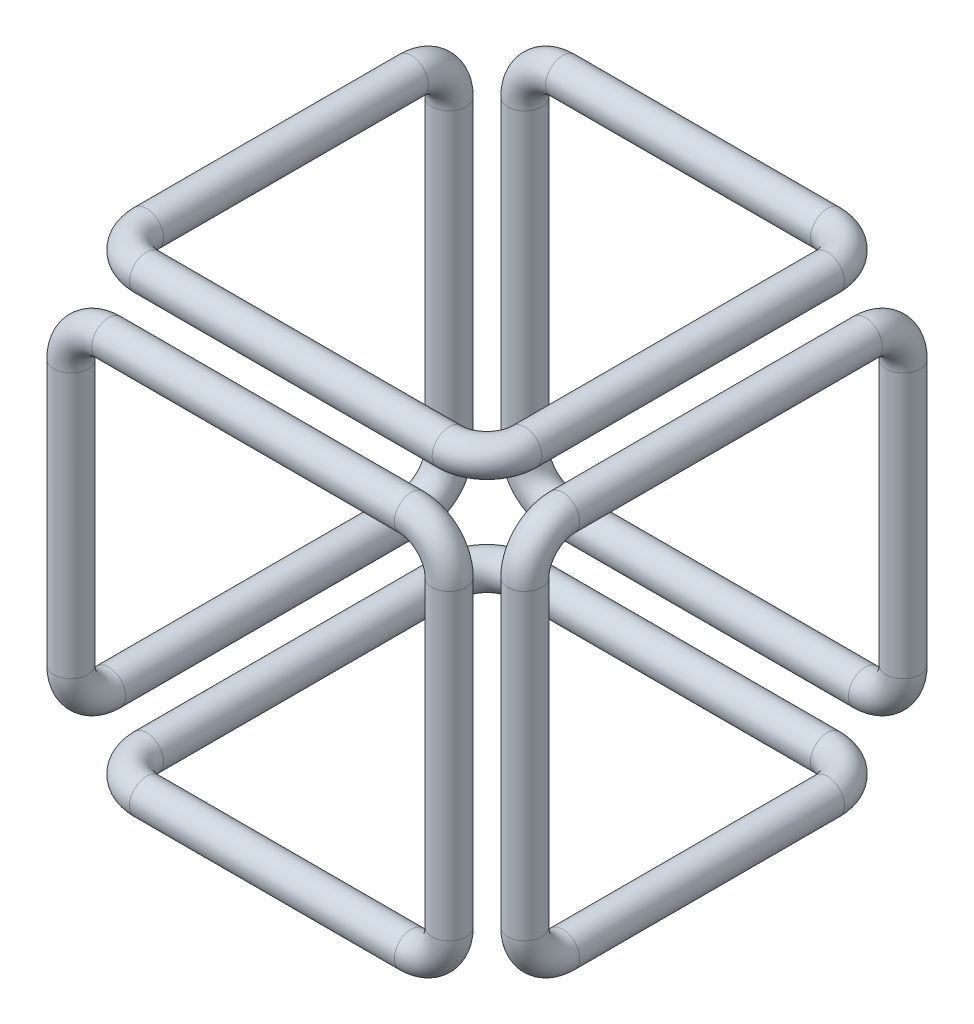
ISO-10303-21;
HEADER;
FILE_DESCRIPTION(('STEP AP214'),'2;1');
FILE_NAME('part.step','',(''),(''),'','','');
FILE_SCHEMA(('AUTOMOTIVE_DESIGN { 1 0 10303 214 1 1 1 1 }'));
ENDSEC;
DATA;
#1=APPLICATION_CONTEXT('core data for automotive mechanical design processes');
#2=APPLICATION_PROTOCOL_DEFINITION('international standard','automotive_design',2000,#1);
#3=PRODUCT_CONTEXT('',#1,'mechanical');
#4=PRODUCT('Part','Part','',(#3));
#5=PRODUCT_RELATED_PRODUCT_CATEGORY('part','',(#4));
#6=PRODUCT_DEFINITION_FORMATION('','',#4);
#7=PRODUCT_DEFINITION_CONTEXT('part definition',#1,'design');
#8=PRODUCT_DEFINITION('design','',#6,#7);
#9=PRODUCT_DEFINITION_SHAPE('','',#8);
#10=(LENGTH_UNIT() NAMED_UNIT(*) SI_UNIT(.MILLI.,.METRE.));
#11=(NAMED_UNIT(*) PLANE_ANGLE_UNIT() SI_UNIT($,.RADIAN.));
#12=(NAMED_UNIT(*) SI_UNIT($,.STERADIAN.) SOLID_ANGLE_UNIT());
#13=UNCERTAINTY_MEASURE_WITH_UNIT(LENGTH_MEASURE(1.E-05),#10,'distance_accuracy_value','');
#14=(GEOMETRIC_REPRESENTATION_CONTEXT(3) GLOBAL_UNCERTAINTY_ASSIGNED_CONTEXT((#13)) GLOBAL_UNIT_ASSIGNED_CONTEXT((#10,
#11,#12)) REPRESENTATION_CONTEXT('',''));
#15=CARTESIAN_POINT('',(0.,0.,0.));
#16=DIRECTION('',(0.,0.,1.));
#17=DIRECTION('',(1.,0.,0.));
#18=AXIS2_PLACEMENT_3D('',#15,#16,#17);
#19=CARTESIAN_POINT('',(90.,0.,10.));
#20=DIRECTION('',(0.,1.,0.));
#21=DIRECTION('',(0.,0.,1.));
#22=AXIS2_PLACEMENT_3D('',#19,#20,#21);
#23=TOROIDAL_SURFACE('',#22,9.99999999999999,4.5);
#24=CARTESIAN_POINT('',(100.,0.,10.));
#25=DIRECTION('',(0.,0.,1.));
#26=DIRECTION('',(1.,0.,0.));
#27=AXIS2_PLACEMENT_3D('',#24,#25,#26);
#28=CIRCLE('',#27,4.5);
#29=CARTESIAN_POINT('',(104.5,0.,10.));
#30=VERTEX_POINT('',#29);
#31=EDGE_CURVE('E185',#30,#30,#28,.T.);
#32=CARTESIAN_POINT('',(90.,0.,0.));
#33=DIRECTION('',(1.,0.,0.));
#34=DIRECTION('',(0.,0.,-1.));
#35=AXIS2_PLACEMENT_3D('',#32,#33,#34);
#36=CIRCLE('',#35,4.5);
#37=CARTESIAN_POINT('',(90.,0.,-4.5));
#38=VERTEX_POINT('',#37);
#39=EDGE_CURVE('E181',#38,#38,#36,.T.);
#40=CARTESIAN_POINT('',(90.,0.,10.));
#41=DIRECTION('',(0.,1.,0.));
#42=DIRECTION('',(0.,0.,1.));
#43=AXIS2_PLACEMENT_3D('',#40,#41,#42);
#44=CIRCLE('',#43,14.5);
#45=EDGE_CURVE('',#30,#38,#44,.T.);
#46=ORIENTED_EDGE('',*,*,#31,.F.);
#47=ORIENTED_EDGE('',*,*,#39,.T.);
#48=ORIENTED_EDGE('',*,*,#45,.T.);
#49=ORIENTED_EDGE('',*,*,#45,.F.);
#50=EDGE_LOOP('',(#46,#48,#47,#49));
#51=FACE_BOUND('',#50,.T.);
#52=ADVANCED_FACE('F37',(#51),#23,.T.);
#53=CARTESIAN_POINT('',(90.,0.,0.));
#54=DIRECTION('',(-1.,0.,0.));
#55=DIRECTION('',(0.,0.,1.));
#56=AXIS2_PLACEMENT_3D('',#53,#54,#55);
#57=CYLINDRICAL_SURFACE('',#56,4.5);
#58=CARTESIAN_POINT('',(9.99999999999999,0.,0.));
#59=DIRECTION('',(1.,0.,0.));
#60=DIRECTION('',(0.,0.,-1.));
#61=AXIS2_PLACEMENT_3D('',#58,#59,#60);
#62=CIRCLE('',#61,4.5);
#63=CARTESIAN_POINT('',(9.99999999999999,0.,-4.5));
#64=VERTEX_POINT('',#63);
#65=EDGE_CURVE('E177',#64,#64,#62,.T.);
#66=ORIENTED_EDGE('',*,*,#65,.T.);
#67=EDGE_LOOP('',(#66));
#68=FACE_BOUND('',#67,.T.);
#69=ORIENTED_EDGE('',*,*,#39,.F.);
#70=EDGE_LOOP('',(#69));
#71=FACE_BOUND('',#70,.T.);
#72=ADVANCED_FACE('F193',(#68,#71),#57,.T.);
#73=CARTESIAN_POINT('',(10.,0.,9.99999999999999));
#74=DIRECTION('',(0.,1.,0.));
#75=DIRECTION('',(0.,0.,1.));
#76=AXIS2_PLACEMENT_3D('',#73,#74,#75);
#77=TOROIDAL_SURFACE('',#76,9.99999999999999,4.5);
#78=CARTESIAN_POINT('',(0.,0.,9.99999999999999));
#79=DIRECTION('',(0.,0.,-1.));
#80=DIRECTION('',(-1.,0.,0.));
#81=AXIS2_PLACEMENT_3D('',#78,#79,#80);
#82=CIRCLE('',#81,4.5);
#83=CARTESIAN_POINT('',(-4.5,0.,9.99999999999999));
#84=VERTEX_POINT('',#83);
#85=EDGE_CURVE('E173',#84,#84,#82,.T.);
#86=CARTESIAN_POINT('',(10.,0.,9.99999999999999));
#87=DIRECTION('',(0.,1.,0.));
#88=DIRECTION('',(0.,0.,1.));
#89=AXIS2_PLACEMENT_3D('',#86,#87,#88);
#90=CIRCLE('',#89,14.5);
#91=EDGE_CURVE('',#64,#84,#90,.T.);
#92=ORIENTED_EDGE('',*,*,#65,.F.);
#93=ORIENTED_EDGE('',*,*,#85,.T.);
#94=ORIENTED_EDGE('',*,*,#91,.T.);
#95=ORIENTED_EDGE('',*,*,#91,.F.);
#96=EDGE_LOOP('',(#92,#94,#93,#95));
#97=FACE_BOUND('',#96,.T.);
#98=ADVANCED_FACE('F199',(#97),#77,.T.);
#99=CARTESIAN_POINT('',(0.,0.,9.99999999999999));
#100=DIRECTION('',(0.,0.,1.));
#101=DIRECTION('',(0.,-1.,0.));
#102=AXIS2_PLACEMENT_3D('',#99,#100,#101);
#103=CYLINDRICAL_SURFACE('',#102,4.5);
#104=CARTESIAN_POINT('',(0.,0.,89.9999999999998));
#105=DIRECTION('',(0.,0.,-1.));
#106=DIRECTION('',(-1.,0.,0.));
#107=AXIS2_PLACEMENT_3D('',#104,#105,#106);
#108=CIRCLE('',#107,4.5);
#109=CARTESIAN_POINT('',(-4.50000000000001,0.,89.9999999999998));
#110=VERTEX_POINT('',#109);
#111=EDGE_CURVE('E169',#110,#110,#108,.T.);
#112=ORIENTED_EDGE('',*,*,#111,.T.);
#113=EDGE_LOOP('',(#112));
#114=FACE_BOUND('',#113,.T.);
#115=ORIENTED_EDGE('',*,*,#85,.F.);
#116=EDGE_LOOP('',(#115));
#117=FACE_BOUND('',#116,.T.);
#118=ADVANCED_FACE('F205',(#114,#117),#103,.T.);
#119=CARTESIAN_POINT('',(10.,0.,89.9999999999998));
#120=DIRECTION('',(0.,1.,0.));
#121=DIRECTION('',(-1.,0.,0.));
#122=AXIS2_PLACEMENT_3D('',#119,#120,#121);
#123=TOROIDAL_SURFACE('',#122,10.,4.5);
#124=CARTESIAN_POINT('',(10.,0.,99.9999999999998));
#125=DIRECTION('',(-1.,0.,0.));
#126=DIRECTION('',(0.,0.,1.));
#127=AXIS2_PLACEMENT_3D('',#124,#125,#126);
#128=CIRCLE('',#127,4.5);
#129=CARTESIAN_POINT('',(10.,0.,104.5));
#130=VERTEX_POINT('',#129);
#131=EDGE_CURVE('E165',#130,#130,#128,.T.);
#132=CARTESIAN_POINT('',(10.,0.,89.9999999999998));
#133=DIRECTION('',(0.,1.,0.));
#134=DIRECTION('',(-1.,0.,0.));
#135=AXIS2_PLACEMENT_3D('',#132,#133,#134);
#136=CIRCLE('',#135,14.5);
#137=EDGE_CURVE('',#110,#130,#136,.T.);
#138=ORIENTED_EDGE('',*,*,#111,.F.);
#139=ORIENTED_EDGE('',*,*,#131,.T.);
#140=ORIENTED_EDGE('',*,*,#137,.T.);
#141=ORIENTED_EDGE('',*,*,#137,.F.);
#142=EDGE_LOOP('',(#138,#140,#139,#141));
#143=FACE_BOUND('',#142,.T.);
#144=ADVANCED_FACE('F209',(#143),#123,.T.);
#145=CARTESIAN_POINT('',(9.99999999999999,0.,99.9999999999998));
#146=DIRECTION('',(1.,0.,0.));
#147=DIRECTION('',(0.,0.,-1.));
#148=AXIS2_PLACEMENT_3D('',#145,#146,#147);
#149=CYLINDRICAL_SURFACE('',#148,4.5);
#150=CARTESIAN_POINT('',(80.,0.,99.9999999999998));
#151=DIRECTION('',(-1.,0.,0.));
#152=DIRECTION('',(0.,0.,1.));
#153=AXIS2_PLACEMENT_3D('',#150,#151,#152);
#154=CIRCLE('',#153,4.5);
#155=CARTESIAN_POINT('',(80.,-4.50000000000002,99.9999999999998));
#156=VERTEX_POINT('',#155);
#157=EDGE_CURVE('E161',#156,#156,#154,.T.);
#158=ORIENTED_EDGE('',*,*,#157,.T.);
#159=EDGE_LOOP('',(#158));
#160=FACE_BOUND('',#159,.T.);
#161=ORIENTED_EDGE('',*,*,#131,.F.);
#162=EDGE_LOOP('',(#161));
#163=FACE_BOUND('',#162,.T.);
#164=ADVANCED_FACE('F213',(#160,#163),#149,.T.);
#165=CARTESIAN_POINT('',(80.,9.99999999999998,99.9999999999998));
#166=DIRECTION('',(0.,0.,1.));
#167=DIRECTION('',(1.,0.,0.));
#168=AXIS2_PLACEMENT_3D('',#165,#166,#167);
#169=TOROIDAL_SURFACE('',#168,9.99999999999999,4.5);
#170=CARTESIAN_POINT('',(90.,9.99999999999998,99.9999999999998));
#171=DIRECTION('',(0.,-1.,0.));
#172=DIRECTION('',(0.,0.,1.));
#173=AXIS2_PLACEMENT_3D('',#170,#171,#172);
#174=CIRCLE('',#173,4.5);
#175=CARTESIAN_POINT('',(94.5,9.99999999999998,99.9999999999998));
#176=VERTEX_POINT('',#175);
#177=EDGE_CURVE('E157',#176,#176,#174,.T.);
#178=CARTESIAN_POINT('',(80.,9.99999999999998,99.9999999999998));
#179=DIRECTION('',(0.,0.,1.));
#180=DIRECTION('',(1.,0.,0.));
#181=AXIS2_PLACEMENT_3D('',#178,#179,#180);
#182=CIRCLE('',#181,14.5);
#183=EDGE_CURVE('',#156,#176,#182,.T.);
#184=ORIENTED_EDGE('',*,*,#157,.F.);
#185=ORIENTED_EDGE('',*,*,#177,.T.);
#186=ORIENTED_EDGE('',*,*,#183,.T.);
#187=ORIENTED_EDGE('',*,*,#183,.F.);
#188=EDGE_LOOP('',(#184,#186,#185,#187));
#189=FACE_BOUND('',#188,.T.);
#190=ADVANCED_FACE('F217',(#189),#169,.T.);
#191=CARTESIAN_POINT('',(90.,9.99999999999998,99.9999999999998));
#192=DIRECTION('',(0.,1.,0.));
#193=DIRECTION('',(0.,0.,1.));
#194=AXIS2_PLACEMENT_3D('',#191,#192,#193);
#195=CYLINDRICAL_SURFACE('',#194,4.5);
#196=CARTESIAN_POINT('',(90.,90.,99.9999999999998));
#197=DIRECTION('',(0.,-1.,0.));
#198=DIRECTION('',(0.,0.,1.));
#199=AXIS2_PLACEMENT_3D('',#196,#197,#198);
#200=CIRCLE('',#199,4.5);
#201=CARTESIAN_POINT('',(94.5,90.,99.9999999999998));
#202=VERTEX_POINT('',#201);
#203=EDGE_CURVE('E153',#202,#202,#200,.T.);
#204=ORIENTED_EDGE('',*,*,#203,.T.);
#205=EDGE_LOOP('',(#204));
#206=FACE_BOUND('',#205,.T.);
#207=ORIENTED_EDGE('',*,*,#177,.F.);
#208=EDGE_LOOP('',(#207));
#209=FACE_BOUND('',#208,.T.);
#210=ADVANCED_FACE('F221',(#206,#209),#195,.T.);
#211=CARTESIAN_POINT('',(80.,90.,99.9999999999998));
#212=DIRECTION('',(0.,0.,1.));
#213=DIRECTION('',(1.,0.,0.));
#214=AXIS2_PLACEMENT_3D('',#211,#212,#213);
#215=TOROIDAL_SURFACE('',#214,9.99999999999999,4.5);
#216=CARTESIAN_POINT('',(80.,100.,99.9999999999998));
#217=DIRECTION('',(1.,0.,0.));
#218=DIRECTION('',(0.,0.,1.));
#219=AXIS2_PLACEMENT_3D('',#216,#217,#218);
#220=CIRCLE('',#219,4.5);
#221=CARTESIAN_POINT('',(80.,104.5,99.9999999999998));
#222=VERTEX_POINT('',#221);
#223=EDGE_CURVE('E149',#222,#222,#220,.T.);
#224=CARTESIAN_POINT('',(80.,90.,99.9999999999998));
#225=DIRECTION('',(0.,0.,1.));
#226=DIRECTION('',(1.,0.,0.));
#227=AXIS2_PLACEMENT_3D('',#224,#225,#226);
#228=CIRCLE('',#227,14.5);
#229=EDGE_CURVE('',#202,#222,#228,.T.);
#230=ORIENTED_EDGE('',*,*,#203,.F.);
#231=ORIENTED_EDGE('',*,*,#223,.T.);
#232=ORIENTED_EDGE('',*,*,#229,.T.);
#233=ORIENTED_EDGE('',*,*,#229,.F.);
#234=EDGE_LOOP('',(#230,#232,#231,#233));
#235=FACE_BOUND('',#234,.T.);
#236=ADVANCED_FACE('F225',(#235),#215,.T.);
#237=CARTESIAN_POINT('',(80.,100.,99.9999999999998));
#238=DIRECTION('',(-1.,0.,0.));
#239=DIRECTION('',(0.,0.,1.));
#240=AXIS2_PLACEMENT_3D('',#237,#238,#239);
#241=CYLINDRICAL_SURFACE('',#240,4.5);
#242=CARTESIAN_POINT('',(0.,100.,99.9999999999998));
#243=DIRECTION('',(1.,0.,0.));
#244=DIRECTION('',(0.,0.,1.));
#245=AXIS2_PLACEMENT_3D('',#242,#243,#244);
#246=CIRCLE('',#245,4.5);
#247=CARTESIAN_POINT('',(0.,104.5,99.9999999999998));
#248=VERTEX_POINT('',#247);
#249=EDGE_CURVE('E145',#248,#248,#246,.T.);
#250=ORIENTED_EDGE('',*,*,#249,.T.);
#251=EDGE_LOOP('',(#250));
#252=FACE_BOUND('',#251,.T.);
#253=ORIENTED_EDGE('',*,*,#223,.F.);
#254=EDGE_LOOP('',(#253));
#255=FACE_BOUND('',#254,.T.);
#256=ADVANCED_FACE('F229',(#252,#255),#241,.T.);
#257=CARTESIAN_POINT('',(0.,90.,99.9999999999998));
#258=DIRECTION('',(0.,0.,1.));
#259=DIRECTION('',(1.,0.,0.));
#260=AXIS2_PLACEMENT_3D('',#257,#258,#259);
#261=TOROIDAL_SURFACE('',#260,9.99999999999999,4.5);
#262=CARTESIAN_POINT('',(-10.,90.0000000000001,99.9999999999998));
#263=DIRECTION('',(0.,1.,0.));
#264=DIRECTION('',(0.,0.,1.));
#265=AXIS2_PLACEMENT_3D('',#262,#263,#264);
#266=CIRCLE('',#265,4.5);
#267=CARTESIAN_POINT('',(-14.5,90.0000000000001,99.9999999999998));
#268=VERTEX_POINT('',#267);
#269=EDGE_CURVE('E141',#268,#268,#266,.T.);
#270=CARTESIAN_POINT('',(0.,90.,99.9999999999998));
#271=DIRECTION('',(0.,0.,1.));
#272=DIRECTION('',(1.,0.,0.));
#273=AXIS2_PLACEMENT_3D('',#270,#271,#272);
#274=CIRCLE('',#273,14.5);
#275=EDGE_CURVE('',#248,#268,#274,.T.);
#276=ORIENTED_EDGE('',*,*,#249,.F.);
#277=ORIENTED_EDGE('',*,*,#269,.T.);
#278=ORIENTED_EDGE('',*,*,#275,.T.);
#279=ORIENTED_EDGE('',*,*,#275,.F.);
#280=EDGE_LOOP('',(#276,#278,#277,#279));
#281=FACE_BOUND('',#280,.T.);
#282=ADVANCED_FACE('F233',(#281),#261,.T.);
#283=CARTESIAN_POINT('',(-10.,90.0000000000001,99.9999999999998));
#284=DIRECTION('',(0.,-1.,0.));
#285=DIRECTION('',(0.,0.,-1.));
#286=AXIS2_PLACEMENT_3D('',#283,#284,#285);
#287=CYLINDRICAL_SURFACE('',#286,4.5);
#288=CARTESIAN_POINT('',(-10.,20.,99.9999999999998));
#289=DIRECTION('',(0.,1.,0.));
#290=DIRECTION('',(0.,0.,1.));
#291=AXIS2_PLACEMENT_3D('',#288,#289,#290);
#292=CIRCLE('',#291,4.5);
#293=CARTESIAN_POINT('',(-10.,20.,104.5));
#294=VERTEX_POINT('',#293);
#295=EDGE_CURVE('E137',#294,#294,#292,.T.);
#296=ORIENTED_EDGE('',*,*,#295,.T.);
#297=EDGE_LOOP('',(#296));
#298=FACE_BOUND('',#297,.T.);
#299=ORIENTED_EDGE('',*,*,#269,.F.);
#300=EDGE_LOOP('',(#299));
#301=FACE_BOUND('',#300,.T.);
#302=ADVANCED_FACE('F237',(#298,#301),#287,.T.);
#303=CARTESIAN_POINT('',(-10.,20.,89.9999999999998));
#304=DIRECTION('',(1.,0.,0.));
#305=DIRECTION('',(0.,0.,-1.));
#306=AXIS2_PLACEMENT_3D('',#303,#304,#305);
#307=TOROIDAL_SURFACE('',#306,9.99999999999999,4.5);
#308=CARTESIAN_POINT('',(-10.,10.,89.9999999999998));
#309=DIRECTION('',(0.,0.,1.));
#310=DIRECTION('',(0.,-1.,0.));
#311=AXIS2_PLACEMENT_3D('',#308,#309,#310);
#312=CIRCLE('',#311,4.5);
#313=CARTESIAN_POINT('',(-10.,5.50000000000005,89.9999999999998));
#314=VERTEX_POINT('',#313);
#315=EDGE_CURVE('E133',#314,#314,#312,.T.);
#316=CARTESIAN_POINT('',(-10.,20.,89.9999999999998));
#317=DIRECTION('',(1.,0.,0.));
#318=DIRECTION('',(0.,0.,-1.));
#319=AXIS2_PLACEMENT_3D('',#316,#317,#318);
#320=CIRCLE('',#319,14.5);
#321=EDGE_CURVE('',#294,#314,#320,.T.);
#322=ORIENTED_EDGE('',*,*,#295,.F.);
#323=ORIENTED_EDGE('',*,*,#315,.T.);
#324=ORIENTED_EDGE('',*,*,#321,.T.);
#325=ORIENTED_EDGE('',*,*,#321,.F.);
#326=EDGE_LOOP('',(#322,#324,#323,#325));
#327=FACE_BOUND('',#326,.T.);
#328=ADVANCED_FACE('F241',(#327),#307,.T.);
#329=CARTESIAN_POINT('',(-10.,10.,89.9999999999998));
#330=DIRECTION('',(0.,0.,-1.));
#331=DIRECTION('',(-1.,0.,0.));
#332=AXIS2_PLACEMENT_3D('',#329,#330,#331);
#333=CYLINDRICAL_SURFACE('',#332,4.5);
#334=CARTESIAN_POINT('',(-10.,10.,9.99999999999999));
#335=DIRECTION('',(0.,0.,1.));
#336=DIRECTION('',(0.,-1.,0.));
#337=AXIS2_PLACEMENT_3D('',#334,#335,#336);
#338=CIRCLE('',#337,4.5);
#339=CARTESIAN_POINT('',(-10.,5.50000000000005,9.99999999999999));
#340=VERTEX_POINT('',#339);
#341=EDGE_CURVE('E129',#340,#340,#338,.T.);
#342=ORIENTED_EDGE('',*,*,#341,.T.);
#343=EDGE_LOOP('',(#342));
#344=FACE_BOUND('',#343,.T.);
#345=ORIENTED_EDGE('',*,*,#315,.F.);
#346=EDGE_LOOP('',(#345));
#347=FACE_BOUND('',#346,.T.);
#348=ADVANCED_FACE('F245',(#344,#347),#333,.T.);
#349=CARTESIAN_POINT('',(-10.,20.,10.));
#350=DIRECTION('',(1.,0.,0.));
#351=DIRECTION('',(0.,0.,-1.));
#352=AXIS2_PLACEMENT_3D('',#349,#350,#351);
#353=TOROIDAL_SURFACE('',#352,9.99999999999999,4.5);
#354=CARTESIAN_POINT('',(-10.,20.,0.));
#355=DIRECTION('',(0.,-1.,0.));
#356=DIRECTION('',(0.,0.,-1.));
#357=AXIS2_PLACEMENT_3D('',#354,#355,#356);
#358=CIRCLE('',#357,4.5);
#359=CARTESIAN_POINT('',(-10.,20.,-4.5));
#360=VERTEX_POINT('',#359);
#361=EDGE_CURVE('E125',#360,#360,#358,.T.);
#362=CARTESIAN_POINT('',(-10.,20.,10.));
#363=DIRECTION('',(1.,0.,0.));
#364=DIRECTION('',(0.,0.,-1.));
#365=AXIS2_PLACEMENT_3D('',#362,#363,#364);
#366=CIRCLE('',#365,14.5);
#367=EDGE_CURVE('',#340,#360,#366,.T.);
#368=ORIENTED_EDGE('',*,*,#341,.F.);
#369=ORIENTED_EDGE('',*,*,#361,.T.);
#370=ORIENTED_EDGE('',*,*,#367,.T.);
#371=ORIENTED_EDGE('',*,*,#367,.F.);
#372=EDGE_LOOP('',(#368,#370,#369,#371));
#373=FACE_BOUND('',#372,.T.);
#374=ADVANCED_FACE('F249',(#373),#353,.T.);
#375=CARTESIAN_POINT('',(-10.,20.,0.));
#376=DIRECTION('',(0.,1.,0.));
#377=DIRECTION('',(0.,0.,1.));
#378=AXIS2_PLACEMENT_3D('',#375,#376,#377);
#379=CYLINDRICAL_SURFACE('',#378,4.5);
#380=CARTESIAN_POINT('',(-10.,100.,0.));
#381=DIRECTION('',(0.,-1.,0.));
#382=DIRECTION('',(0.,0.,-1.));
#383=AXIS2_PLACEMENT_3D('',#380,#381,#382);
#384=CIRCLE('',#383,4.5);
#385=CARTESIAN_POINT('',(-10.,100.,-4.5));
#386=VERTEX_POINT('',#385);
#387=EDGE_CURVE('E121',#386,#386,#384,.T.);
#388=ORIENTED_EDGE('',*,*,#387,.T.);
#389=EDGE_LOOP('',(#388));
#390=FACE_BOUND('',#389,.T.);
#391=ORIENTED_EDGE('',*,*,#361,.F.);
#392=EDGE_LOOP('',(#391));
#393=FACE_BOUND('',#392,.T.);
#394=ADVANCED_FACE('F253',(#390,#393),#379,.T.);
#395=CARTESIAN_POINT('',(-10.,100.,9.99999999999999));
#396=DIRECTION('',(1.,0.,0.));
#397=DIRECTION('',(0.,0.,-1.));
#398=AXIS2_PLACEMENT_3D('',#395,#396,#397);
#399=TOROIDAL_SURFACE('',#398,9.99999999999999,4.5);
#400=CARTESIAN_POINT('',(-10.,110.,9.99999999999999));
#401=DIRECTION('',(0.,0.,-1.));
#402=DIRECTION('',(0.,1.,0.));
#403=AXIS2_PLACEMENT_3D('',#400,#401,#402);
#404=CIRCLE('',#403,4.5);
#405=CARTESIAN_POINT('',(-10.,114.5,9.99999999999999));
#406=VERTEX_POINT('',#405);
#407=EDGE_CURVE('E117',#406,#406,#404,.T.);
#408=CARTESIAN_POINT('',(-10.,100.,9.99999999999999));
#409=DIRECTION('',(1.,0.,0.));
#410=DIRECTION('',(0.,0.,-1.));
#411=AXIS2_PLACEMENT_3D('',#408,#409,#410);
#412=CIRCLE('',#411,14.5);
#413=EDGE_CURVE('',#386,#406,#412,.T.);
#414=ORIENTED_EDGE('',*,*,#387,.F.);
#415=ORIENTED_EDGE('',*,*,#407,.T.);
#416=ORIENTED_EDGE('',*,*,#413,.T.);
#417=ORIENTED_EDGE('',*,*,#413,.F.);
#418=EDGE_LOOP('',(#414,#416,#415,#417));
#419=FACE_BOUND('',#418,.T.);
#420=ADVANCED_FACE('F257',(#419),#399,.T.);
#421=CARTESIAN_POINT('',(-10.,110.,9.99999999999999));
#422=DIRECTION('',(0.,0.,1.));
#423=DIRECTION('',(1.,0.,0.));
#424=AXIS2_PLACEMENT_3D('',#421,#422,#423);
#425=CYLINDRICAL_SURFACE('',#424,4.5);
#426=CARTESIAN_POINT('',(-10.,110.,80.));
#427=DIRECTION('',(0.,0.,-1.));
#428=DIRECTION('',(0.,1.,0.));
#429=AXIS2_PLACEMENT_3D('',#426,#427,#428);
#430=CIRCLE('',#429,4.5);
#431=CARTESIAN_POINT('',(-14.5,110.,80.));
#432=VERTEX_POINT('',#431);
#433=EDGE_CURVE('E113',#432,#432,#430,.T.);
#434=ORIENTED_EDGE('',*,*,#433,.T.);
#435=EDGE_LOOP('',(#434));
#436=FACE_BOUND('',#435,.T.);
#437=ORIENTED_EDGE('',*,*,#407,.F.);
#438=EDGE_LOOP('',(#437));
#439=FACE_BOUND('',#438,.T.);
#440=ADVANCED_FACE('F261',(#436,#439),#425,.T.);
#441=CARTESIAN_POINT('',(0.,110.,80.));
#442=DIRECTION('',(0.,1.,0.));
#443=DIRECTION('',(0.,0.,1.));
#444=AXIS2_PLACEMENT_3D('',#441,#442,#443);
#445=TOROIDAL_SURFACE('',#444,9.99999999999999,4.5);
#446=CARTESIAN_POINT('',(0.,110.,90.));
#447=DIRECTION('',(-1.,0.,0.));
#448=DIRECTION('',(0.,1.,0.));
#449=AXIS2_PLACEMENT_3D('',#446,#447,#448);
#450=CIRCLE('',#449,4.5);
#451=CARTESIAN_POINT('',(0.,110.,94.5));
#452=VERTEX_POINT('',#451);
#453=EDGE_CURVE('E109',#452,#452,#450,.T.);
#454=CARTESIAN_POINT('',(0.,110.,80.));
#455=DIRECTION('',(0.,1.,0.));
#456=DIRECTION('',(0.,0.,1.));
#457=AXIS2_PLACEMENT_3D('',#454,#455,#456);
#458=CIRCLE('',#457,14.5);
#459=EDGE_CURVE('',#432,#452,#458,.T.);
#460=ORIENTED_EDGE('',*,*,#433,.F.);
#461=ORIENTED_EDGE('',*,*,#453,.T.);
#462=ORIENTED_EDGE('',*,*,#459,.T.);
#463=ORIENTED_EDGE('',*,*,#459,.F.);
#464=EDGE_LOOP('',(#460,#462,#461,#463));
#465=FACE_BOUND('',#464,.T.);
#466=ADVANCED_FACE('F265',(#465),#445,.T.);
#467=CARTESIAN_POINT('',(0.,110.,90.));
#468=DIRECTION('',(1.,0.,0.));
#469=DIRECTION('',(0.,0.,-1.));
#470=AXIS2_PLACEMENT_3D('',#467,#468,#469);
#471=CYLINDRICAL_SURFACE('',#470,4.5);
#472=CARTESIAN_POINT('',(80.,110.,90.));
#473=DIRECTION('',(-1.,0.,0.));
#474=DIRECTION('',(0.,1.,0.));
#475=AXIS2_PLACEMENT_3D('',#472,#473,#474);
#476=CIRCLE('',#475,4.5);
#477=CARTESIAN_POINT('',(80.,110.,94.5));
#478=VERTEX_POINT('',#477);
#479=EDGE_CURVE('E105',#478,#478,#476,.T.);
#480=ORIENTED_EDGE('',*,*,#479,.T.);
#481=EDGE_LOOP('',(#480));
#482=FACE_BOUND('',#481,.T.);
#483=ORIENTED_EDGE('',*,*,#453,.F.);
#484=EDGE_LOOP('',(#483));
#485=FACE_BOUND('',#484,.T.);
#486=ADVANCED_FACE('F269',(#482,#485),#471,.T.);
#487=CARTESIAN_POINT('',(80.,110.,80.));
#488=DIRECTION('',(0.,1.,0.));
#489=DIRECTION('',(0.,0.,1.));
#490=AXIS2_PLACEMENT_3D('',#487,#488,#489);
#491=TOROIDAL_SURFACE('',#490,9.99999999999999,4.5);
#492=CARTESIAN_POINT('',(90.,110.,80.));
#493=DIRECTION('',(0.,0.,1.));
#494=DIRECTION('',(0.,1.,0.));
#495=AXIS2_PLACEMENT_3D('',#492,#493,#494);
#496=CIRCLE('',#495,4.5);
#497=CARTESIAN_POINT('',(94.5,110.,80.));
#498=VERTEX_POINT('',#497);
#499=EDGE_CURVE('E101',#498,#498,#496,.T.);
#500=CARTESIAN_POINT('',(80.,110.,80.));
#501=DIRECTION('',(0.,1.,0.));
#502=DIRECTION('',(0.,0.,1.));
#503=AXIS2_PLACEMENT_3D('',#500,#501,#502);
#504=CIRCLE('',#503,14.5);
#505=EDGE_CURVE('',#478,#498,#504,.T.);
#506=ORIENTED_EDGE('',*,*,#479,.F.);
#507=ORIENTED_EDGE('',*,*,#499,.T.);
#508=ORIENTED_EDGE('',*,*,#505,.T.);
#509=ORIENTED_EDGE('',*,*,#505,.F.);
#510=EDGE_LOOP('',(#506,#508,#507,#509));
#511=FACE_BOUND('',#510,.T.);
#512=ADVANCED_FACE('F273',(#511),#491,.T.);
#513=CARTESIAN_POINT('',(90.,110.,80.));
#514=DIRECTION('',(0.,0.,-1.));
#515=DIRECTION('',(-1.,0.,0.));
#516=AXIS2_PLACEMENT_3D('',#513,#514,#515);
#517=CYLINDRICAL_SURFACE('',#516,4.5);
#518=CARTESIAN_POINT('',(90.,110.,0.));
#519=DIRECTION('',(0.,0.,1.));
#520=DIRECTION('',(0.,1.,0.));
#521=AXIS2_PLACEMENT_3D('',#518,#519,#520);
#522=CIRCLE('',#521,4.5);
#523=CARTESIAN_POINT('',(94.5,110.,0.));
#524=VERTEX_POINT('',#523);
#525=EDGE_CURVE('E97',#524,#524,#522,.T.);
#526=ORIENTED_EDGE('',*,*,#525,.T.);
#527=EDGE_LOOP('',(#526));
#528=FACE_BOUND('',#527,.T.);
#529=ORIENTED_EDGE('',*,*,#499,.F.);
#530=EDGE_LOOP('',(#529));
#531=FACE_BOUND('',#530,.T.);
#532=ADVANCED_FACE('F277',(#528,#531),#517,.T.);
#533=CARTESIAN_POINT('',(80.,110.,0.));
#534=DIRECTION('',(0.,1.,0.));
#535=DIRECTION('',(0.,0.,1.));
#536=AXIS2_PLACEMENT_3D('',#533,#534,#535);
#537=TOROIDAL_SURFACE('',#536,9.99999999999999,4.5);
#538=CARTESIAN_POINT('',(80.,110.,-10.));
#539=DIRECTION('',(1.,0.,0.));
#540=DIRECTION('',(0.,1.,0.));
#541=AXIS2_PLACEMENT_3D('',#538,#539,#540);
#542=CIRCLE('',#541,4.5);
#543=CARTESIAN_POINT('',(80.,110.,-14.5));
#544=VERTEX_POINT('',#543);
#545=EDGE_CURVE('E93',#544,#544,#542,.T.);
#546=CARTESIAN_POINT('',(80.,110.,0.));
#547=DIRECTION('',(0.,1.,0.));
#548=DIRECTION('',(0.,0.,1.));
#549=AXIS2_PLACEMENT_3D('',#546,#547,#548);
#550=CIRCLE('',#549,14.5);
#551=EDGE_CURVE('',#524,#544,#550,.T.);
#552=ORIENTED_EDGE('',*,*,#525,.F.);
#553=ORIENTED_EDGE('',*,*,#545,.T.);
#554=ORIENTED_EDGE('',*,*,#551,.T.);
#555=ORIENTED_EDGE('',*,*,#551,.F.);
#556=EDGE_LOOP('',(#552,#554,#553,#555));
#557=FACE_BOUND('',#556,.T.);
#558=ADVANCED_FACE('F281',(#557),#537,.T.);
#559=CARTESIAN_POINT('',(80.,110.,-10.));
#560=DIRECTION('',(-1.,0.,0.));
#561=DIRECTION('',(0.,0.,1.));
#562=AXIS2_PLACEMENT_3D('',#559,#560,#561);
#563=CYLINDRICAL_SURFACE('',#562,4.5);
#564=CARTESIAN_POINT('',(10.,110.,-10.));
#565=DIRECTION('',(1.,0.,0.));
#566=DIRECTION('',(0.,1.,0.));
#567=AXIS2_PLACEMENT_3D('',#564,#565,#566);
#568=CIRCLE('',#567,4.5);
#569=CARTESIAN_POINT('',(10.,114.5,-10.));
#570=VERTEX_POINT('',#569);
#571=EDGE_CURVE('E89',#570,#570,#568,.T.);
#572=ORIENTED_EDGE('',*,*,#571,.T.);
#573=EDGE_LOOP('',(#572));
#574=FACE_BOUND('',#573,.T.);
#575=ORIENTED_EDGE('',*,*,#545,.F.);
#576=EDGE_LOOP('',(#575));
#577=FACE_BOUND('',#576,.T.);
#578=ADVANCED_FACE('F285',(#574,#577),#563,.T.);
#579=CARTESIAN_POINT('',(10.,100.,-10.));
#580=DIRECTION('',(0.,0.,1.));
#581=DIRECTION('',(1.,0.,0.));
#582=AXIS2_PLACEMENT_3D('',#579,#580,#581);
#583=TOROIDAL_SURFACE('',#582,9.99999999999999,4.5);
#584=CARTESIAN_POINT('',(0.,100.,-10.));
#585=DIRECTION('',(0.,1.,0.));
#586=DIRECTION('',(-1.,0.,0.));
#587=AXIS2_PLACEMENT_3D('',#584,#585,#586);
#588=CIRCLE('',#587,4.5);
#589=CARTESIAN_POINT('',(-4.5,100.,-10.));
#590=VERTEX_POINT('',#589);
#591=EDGE_CURVE('E85',#590,#590,#588,.T.);
#592=CARTESIAN_POINT('',(10.,100.,-10.));
#593=DIRECTION('',(0.,0.,1.));
#594=DIRECTION('',(1.,0.,0.));
#595=AXIS2_PLACEMENT_3D('',#592,#593,#594);
#596=CIRCLE('',#595,14.5);
#597=EDGE_CURVE('',#570,#590,#596,.T.);
#598=ORIENTED_EDGE('',*,*,#571,.F.);
#599=ORIENTED_EDGE('',*,*,#591,.T.);
#600=ORIENTED_EDGE('',*,*,#597,.T.);
#601=ORIENTED_EDGE('',*,*,#597,.F.);
#602=EDGE_LOOP('',(#598,#600,#599,#601));
#603=FACE_BOUND('',#602,.T.);
#604=ADVANCED_FACE('F289',(#603),#583,.T.);
#605=CARTESIAN_POINT('',(0.,100.,-10.));
#606=DIRECTION('',(0.,-1.,0.));
#607=DIRECTION('',(0.,0.,-1.));
#608=AXIS2_PLACEMENT_3D('',#605,#606,#607);
#609=CYLINDRICAL_SURFACE('',#608,4.5);
#610=CARTESIAN_POINT('',(0.,20.,-10.));
#611=DIRECTION('',(0.,1.,0.));
#612=DIRECTION('',(-1.,0.,0.));
#613=AXIS2_PLACEMENT_3D('',#610,#611,#612);
#614=CIRCLE('',#613,4.5);
#615=CARTESIAN_POINT('',(-4.50000000000001,20.,-10.));
#616=VERTEX_POINT('',#615);
#617=EDGE_CURVE('E81',#616,#616,#614,.T.);
#618=ORIENTED_EDGE('',*,*,#617,.T.);
#619=EDGE_LOOP('',(#618));
#620=FACE_BOUND('',#619,.T.);
#621=ORIENTED_EDGE('',*,*,#591,.F.);
#622=EDGE_LOOP('',(#621));
#623=FACE_BOUND('',#622,.T.);
#624=ADVANCED_FACE('F293',(#620,#623),#609,.T.);
#625=CARTESIAN_POINT('',(10.,20.,-10.));
#626=DIRECTION('',(0.,0.,1.));
#627=DIRECTION('',(1.,0.,0.));
#628=AXIS2_PLACEMENT_3D('',#625,#626,#627);
#629=TOROIDAL_SURFACE('',#628,10.,4.5);
#630=CARTESIAN_POINT('',(9.99999999999999,10.,-10.));
#631=DIRECTION('',(-1.,0.,0.));
#632=DIRECTION('',(0.,-1.,0.));
#633=AXIS2_PLACEMENT_3D('',#630,#631,#632);
#634=CIRCLE('',#633,4.5);
#635=CARTESIAN_POINT('',(9.99999999999999,5.50000000000003,-10.));
#636=VERTEX_POINT('',#635);
#637=EDGE_CURVE('E77',#636,#636,#634,.T.);
#638=CARTESIAN_POINT('',(10.,20.,-10.));
#639=DIRECTION('',(0.,0.,1.));
#640=DIRECTION('',(1.,0.,0.));
#641=AXIS2_PLACEMENT_3D('',#638,#639,#640);
#642=CIRCLE('',#641,14.5);
#643=EDGE_CURVE('',#616,#636,#642,.T.);
#644=ORIENTED_EDGE('',*,*,#617,.F.);
#645=ORIENTED_EDGE('',*,*,#637,.T.);
#646=ORIENTED_EDGE('',*,*,#643,.T.);
#647=ORIENTED_EDGE('',*,*,#643,.F.);
#648=EDGE_LOOP('',(#644,#646,#645,#647));
#649=FACE_BOUND('',#648,.T.);
#650=ADVANCED_FACE('F297',(#649),#629,.T.);
#651=CARTESIAN_POINT('',(9.99999999999999,10.,-10.));
#652=DIRECTION('',(1.,0.,0.));
#653=DIRECTION('',(0.,0.,-1.));
#654=AXIS2_PLACEMENT_3D('',#651,#652,#653);
#655=CYLINDRICAL_SURFACE('',#654,4.5);
#656=CARTESIAN_POINT('',(90.,10.,-10.));
#657=DIRECTION('',(-1.,0.,0.));
#658=DIRECTION('',(0.,-1.,0.));
#659=AXIS2_PLACEMENT_3D('',#656,#657,#658);
#660=CIRCLE('',#659,4.5);
#661=CARTESIAN_POINT('',(90.,5.50000000000003,-10.));
#662=VERTEX_POINT('',#661);
#663=EDGE_CURVE('E73',#662,#662,#660,.T.);
#664=ORIENTED_EDGE('',*,*,#663,.T.);
#665=EDGE_LOOP('',(#664));
#666=FACE_BOUND('',#665,.T.);
#667=ORIENTED_EDGE('',*,*,#637,.F.);
#668=EDGE_LOOP('',(#667));
#669=FACE_BOUND('',#668,.T.);
#670=ADVANCED_FACE('F301',(#666,#669),#655,.T.);
#671=CARTESIAN_POINT('',(90.,20.,-10.));
#672=DIRECTION('',(0.,0.,1.));
#673=DIRECTION('',(1.,0.,0.));
#674=AXIS2_PLACEMENT_3D('',#671,#672,#673);
#675=TOROIDAL_SURFACE('',#674,9.99999999999999,4.5);
#676=CARTESIAN_POINT('',(100.,20.,-10.));
#677=DIRECTION('',(0.,-1.,0.));
#678=DIRECTION('',(1.,0.,0.));
#679=AXIS2_PLACEMENT_3D('',#676,#677,#678);
#680=CIRCLE('',#679,4.5);
#681=CARTESIAN_POINT('',(104.5,20.,-10.));
#682=VERTEX_POINT('',#681);
#683=EDGE_CURVE('E69',#682,#682,#680,.T.);
#684=CARTESIAN_POINT('',(90.,20.,-10.));
#685=DIRECTION('',(0.,0.,1.));
#686=DIRECTION('',(1.,0.,0.));
#687=AXIS2_PLACEMENT_3D('',#684,#685,#686);
#688=CIRCLE('',#687,14.5);
#689=EDGE_CURVE('',#662,#682,#688,.T.);
#690=ORIENTED_EDGE('',*,*,#663,.F.);
#691=ORIENTED_EDGE('',*,*,#683,.T.);
#692=ORIENTED_EDGE('',*,*,#689,.T.);
#693=ORIENTED_EDGE('',*,*,#689,.F.);
#694=EDGE_LOOP('',(#690,#692,#691,#693));
#695=FACE_BOUND('',#694,.T.);
#696=ADVANCED_FACE('F305',(#695),#675,.T.);
#697=CARTESIAN_POINT('',(100.,20.,-10.));
#698=DIRECTION('',(0.,1.,0.));
#699=DIRECTION('',(0.,0.,1.));
#700=AXIS2_PLACEMENT_3D('',#697,#698,#699);
#701=CYLINDRICAL_SURFACE('',#700,4.5);
#702=CARTESIAN_POINT('',(100.,90.,-10.));
#703=DIRECTION('',(0.,-1.,0.));
#704=DIRECTION('',(1.,0.,0.));
#705=AXIS2_PLACEMENT_3D('',#702,#703,#704);
#706=CIRCLE('',#705,4.5);
#707=CARTESIAN_POINT('',(100.,90.,-14.5));
#708=VERTEX_POINT('',#707);
#709=EDGE_CURVE('E65',#708,#708,#706,.T.);
#710=ORIENTED_EDGE('',*,*,#709,.T.);
#711=EDGE_LOOP('',(#710));
#712=FACE_BOUND('',#711,.T.);
#713=ORIENTED_EDGE('',*,*,#683,.F.);
#714=EDGE_LOOP('',(#713));
#715=FACE_BOUND('',#714,.T.);
#716=ADVANCED_FACE('F309',(#712,#715),#701,.T.);
#717=CARTESIAN_POINT('',(100.,90.,0.));
#718=DIRECTION('',(1.,0.,0.));
#719=DIRECTION('',(0.,0.,-1.));
#720=AXIS2_PLACEMENT_3D('',#717,#718,#719);
#721=TOROIDAL_SURFACE('',#720,9.99999999999999,4.5);
#722=CARTESIAN_POINT('',(100.,100.,0.));
#723=DIRECTION('',(0.,0.,-1.));
#724=DIRECTION('',(1.,0.,0.));
#725=AXIS2_PLACEMENT_3D('',#722,#723,#724);
#726=CIRCLE('',#725,4.5);
#727=CARTESIAN_POINT('',(100.,104.5,0.));
#728=VERTEX_POINT('',#727);
#729=EDGE_CURVE('E61',#728,#728,#726,.T.);
#730=CARTESIAN_POINT('',(100.,90.,0.));
#731=DIRECTION('',(1.,0.,0.));
#732=DIRECTION('',(0.,0.,-1.));
#733=AXIS2_PLACEMENT_3D('',#730,#731,#732);
#734=CIRCLE('',#733,14.5);
#735=EDGE_CURVE('',#708,#728,#734,.T.);
#736=ORIENTED_EDGE('',*,*,#709,.F.);
#737=ORIENTED_EDGE('',*,*,#729,.T.);
#738=ORIENTED_EDGE('',*,*,#735,.T.);
#739=ORIENTED_EDGE('',*,*,#735,.F.);
#740=EDGE_LOOP('',(#736,#738,#737,#739));
#741=FACE_BOUND('',#740,.T.);
#742=ADVANCED_FACE('F313',(#741),#721,.T.);
#743=CARTESIAN_POINT('',(100.,100.,0.));
#744=DIRECTION('',(0.,0.,1.));
#745=DIRECTION('',(0.,-1.,0.));
#746=AXIS2_PLACEMENT_3D('',#743,#744,#745);
#747=CYLINDRICAL_SURFACE('',#746,4.5);
#748=CARTESIAN_POINT('',(100.,100.,80.));
#749=DIRECTION('',(0.,0.,-1.));
#750=DIRECTION('',(1.,0.,0.));
#751=AXIS2_PLACEMENT_3D('',#748,#749,#750);
#752=CIRCLE('',#751,4.5);
#753=CARTESIAN_POINT('',(100.,104.5,80.));
#754=VERTEX_POINT('',#753);
#755=EDGE_CURVE('E55',#754,#754,#752,.T.);
#756=ORIENTED_EDGE('',*,*,#755,.T.);
#757=EDGE_LOOP('',(#756));
#758=FACE_BOUND('',#757,.T.);
#759=ORIENTED_EDGE('',*,*,#729,.F.);
#760=EDGE_LOOP('',(#759));
#761=FACE_BOUND('',#760,.T.);
#762=ADVANCED_FACE('F317',(#758,#761),#747,.T.);
#763=CARTESIAN_POINT('',(100.,90.,80.));
#764=DIRECTION('',(1.,0.,0.));
#765=DIRECTION('',(0.,0.,-1.));
#766=AXIS2_PLACEMENT_3D('',#763,#764,#765);
#767=TOROIDAL_SURFACE('',#766,9.99999999999999,4.5);
#768=CARTESIAN_POINT('',(100.,90.,90.));
#769=DIRECTION('',(0.,1.,0.));
#770=DIRECTION('',(1.,0.,0.));
#771=AXIS2_PLACEMENT_3D('',#768,#769,#770);
#772=CIRCLE('',#771,4.5);
#773=CARTESIAN_POINT('',(100.,90.,94.5));
#774=VERTEX_POINT('',#773);
#775=EDGE_CURVE('E50',#774,#774,#772,.T.);
#776=CARTESIAN_POINT('',(100.,90.,80.));
#777=DIRECTION('',(1.,0.,0.));
#778=DIRECTION('',(0.,0.,-1.));
#779=AXIS2_PLACEMENT_3D('',#776,#777,#778);
#780=CIRCLE('',#779,14.5);
#781=EDGE_CURVE('',#754,#774,#780,.T.);
#782=ORIENTED_EDGE('',*,*,#755,.F.);
#783=ORIENTED_EDGE('',*,*,#775,.T.);
#784=ORIENTED_EDGE('',*,*,#781,.T.);
#785=ORIENTED_EDGE('',*,*,#781,.F.);
#786=EDGE_LOOP('',(#782,#784,#783,#785));
#787=FACE_BOUND('',#786,.T.);
#788=ADVANCED_FACE('F321',(#787),#767,.T.);
#789=CARTESIAN_POINT('',(100.,90.,90.));
#790=DIRECTION('',(0.,-1.,0.));
#791=DIRECTION('',(0.,0.,-1.));
#792=AXIS2_PLACEMENT_3D('',#789,#790,#791);
#793=CYLINDRICAL_SURFACE('',#792,4.5);
#794=CARTESIAN_POINT('',(100.,9.99999999999999,90.));
#795=DIRECTION('',(0.,1.,0.));
#796=DIRECTION('',(1.,0.,0.));
#797=AXIS2_PLACEMENT_3D('',#794,#795,#796);
#798=CIRCLE('',#797,4.5);
#799=CARTESIAN_POINT('',(100.,9.99999999999999,94.5));
#800=VERTEX_POINT('',#799);
#801=EDGE_CURVE('E45',#800,#800,#798,.T.);
#802=ORIENTED_EDGE('',*,*,#801,.T.);
#803=EDGE_LOOP('',(#802));
#804=FACE_BOUND('',#803,.T.);
#805=ORIENTED_EDGE('',*,*,#775,.F.);
#806=EDGE_LOOP('',(#805));
#807=FACE_BOUND('',#806,.T.);
#808=ADVANCED_FACE('F325',(#804,#807),#793,.T.);
#809=CARTESIAN_POINT('',(100.,9.99999999999999,80.));
#810=DIRECTION('',(1.,0.,0.));
#811=DIRECTION('',(0.,0.,-1.));
#812=AXIS2_PLACEMENT_3D('',#809,#810,#811);
#813=TOROIDAL_SURFACE('',#812,9.99999999999999,4.5);
#814=CARTESIAN_POINT('',(100.,0.,80.));
#815=DIRECTION('',(0.,0.,1.));
#816=DIRECTION('',(1.,0.,0.));
#817=AXIS2_PLACEMENT_3D('',#814,#815,#816);
#818=CIRCLE('',#817,4.5);
#819=CARTESIAN_POINT('',(100.,-4.5,80.));
#820=VERTEX_POINT('',#819);
#821=EDGE_CURVE('E10',#820,#820,#818,.T.);
#822=CARTESIAN_POINT('',(100.,9.99999999999999,80.));
#823=DIRECTION('',(1.,0.,0.));
#824=DIRECTION('',(0.,0.,-1.));
#825=AXIS2_PLACEMENT_3D('',#822,#823,#824);
#826=CIRCLE('',#825,14.5);
#827=EDGE_CURVE('',#800,#820,#826,.T.);
#828=ORIENTED_EDGE('',*,*,#801,.F.);
#829=ORIENTED_EDGE('',*,*,#821,.T.);
#830=ORIENTED_EDGE('',*,*,#827,.T.);
#831=ORIENTED_EDGE('',*,*,#827,.F.);
#832=EDGE_LOOP('',(#828,#830,#829,#831));
#833=FACE_BOUND('',#832,.T.);
#834=ADVANCED_FACE('F328',(#833),#813,.T.);
#835=CARTESIAN_POINT('',(100.,0.,80.));
#836=DIRECTION('',(0.,0.,-1.));
#837=DIRECTION('',(-1.,0.,0.));
#838=AXIS2_PLACEMENT_3D('',#835,#836,#837);
#839=CYLINDRICAL_SURFACE('',#838,4.5);
#840=ORIENTED_EDGE('',*,*,#31,.T.);
#841=EDGE_LOOP('',(#840));
#842=FACE_BOUND('',#841,.T.);
#843=ORIENTED_EDGE('',*,*,#821,.F.);
#844=EDGE_LOOP('',(#843));
#845=FACE_BOUND('',#844,.T.);
#846=ADVANCED_FACE('F39',(#842,#845),#839,.T.);
#847=CLOSED_SHELL('',(#52,#72,#98,#118,#144,#164,#190,#210,#236,#256,#282,#302,#328,#348,#374,
#394,#420,#440,#466,#486,#512,#532,#558,#578,#604,#624,#650,#670,#696,#716,#742,#762,#788,#808,
#834,#846));
#848=MANIFOLD_SOLID_BREP('B2',#847);
#849=ADVANCED_BREP_SHAPE_REPRESENTATION('',(#18,#848),#14);
#850=SHAPE_DEFINITION_REPRESENTATION(#9,#849);
ENDSEC;
END-ISO-10303-21;
